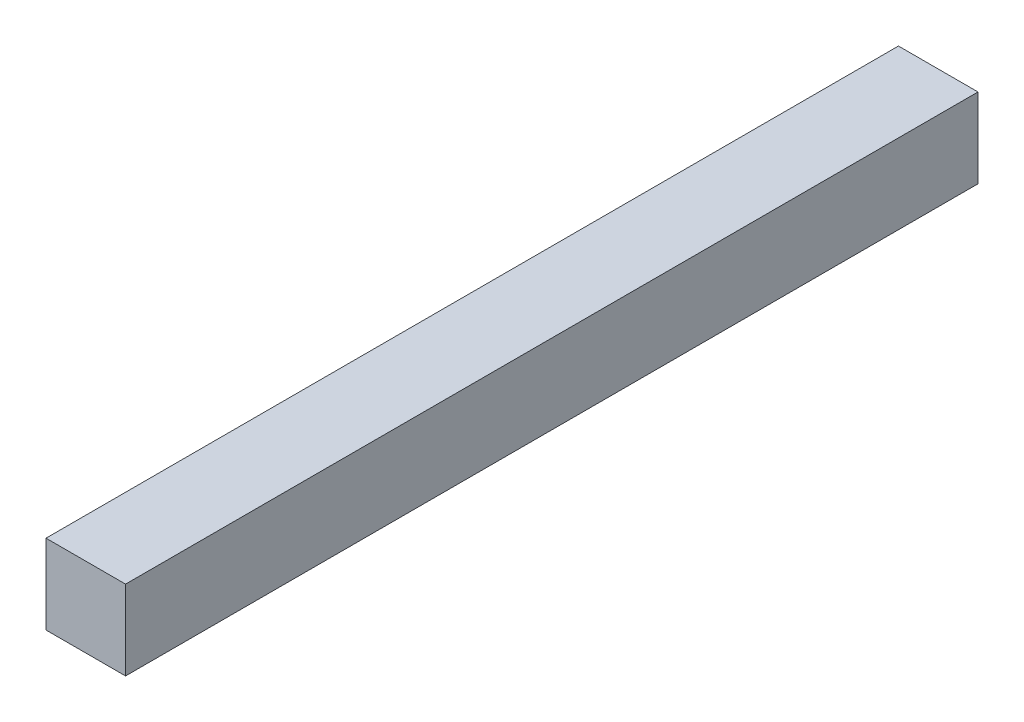
ISO-10303-21;
HEADER;
FILE_DESCRIPTION(('STEP AP214'),'2;1');
FILE_NAME('part.step','',(''),(''),'','','');
FILE_SCHEMA(('AUTOMOTIVE_DESIGN { 1 0 10303 214 1 1 1 1 }'));
ENDSEC;
DATA;
#1=APPLICATION_CONTEXT('core data for automotive mechanical design processes');
#2=APPLICATION_PROTOCOL_DEFINITION('international standard','automotive_design',2000,#1);
#3=PRODUCT_CONTEXT('',#1,'mechanical');
#4=PRODUCT('Part','Part','',(#3));
#5=PRODUCT_RELATED_PRODUCT_CATEGORY('part','',(#4));
#6=PRODUCT_DEFINITION_FORMATION('','',#4);
#7=PRODUCT_DEFINITION_CONTEXT('part definition',#1,'design');
#8=PRODUCT_DEFINITION('design','',#6,#7);
#9=PRODUCT_DEFINITION_SHAPE('','',#8);
#10=(LENGTH_UNIT() NAMED_UNIT(*) SI_UNIT(.MILLI.,.METRE.));
#11=(NAMED_UNIT(*) PLANE_ANGLE_UNIT() SI_UNIT($,.RADIAN.));
#12=(NAMED_UNIT(*) SI_UNIT($,.STERADIAN.) SOLID_ANGLE_UNIT());
#13=UNCERTAINTY_MEASURE_WITH_UNIT(LENGTH_MEASURE(1.E-05),#10,'distance_accuracy_value','');
#14=(GEOMETRIC_REPRESENTATION_CONTEXT(3) GLOBAL_UNCERTAINTY_ASSIGNED_CONTEXT((#13)) GLOBAL_UNIT_ASSIGNED_CONTEXT((#10,
#11,#12)) REPRESENTATION_CONTEXT('',''));
#15=CARTESIAN_POINT('',(0.,0.,0.));
#16=DIRECTION('',(0.,0.,1.));
#17=DIRECTION('',(1.,0.,0.));
#18=AXIS2_PLACEMENT_3D('',#15,#16,#17);
#19=CARTESIAN_POINT('',(1.4,1.4,30.));
#20=DIRECTION('',(-1.,0.,0.));
#21=DIRECTION('',(0.,-1.,0.));
#22=AXIS2_PLACEMENT_3D('',#19,#20,#21);
#23=PLANE('',#22);
#24=DIRECTION('',(0.,1.,0.));
#25=VECTOR('',#24,1.);
#26=CARTESIAN_POINT('',(1.4,1.4,0.));
#27=LINE('',#26,#25);
#28=CARTESIAN_POINT('',(1.4,-1.4,0.));
#29=VERTEX_POINT('',#28);
#30=CARTESIAN_POINT('',(1.4,1.4,0.));
#31=VERTEX_POINT('',#30);
#32=EDGE_CURVE('E107',#29,#31,#27,.T.);
#33=ORIENTED_EDGE('',*,*,#32,.T.);
#34=DIRECTION('',(0.,0.,-1.));
#35=VECTOR('',#34,1.);
#36=CARTESIAN_POINT('',(1.4,1.4,30.));
#37=LINE('',#36,#35);
#38=CARTESIAN_POINT('',(1.4,1.4,30.));
#39=VERTEX_POINT('',#38);
#40=EDGE_CURVE('E11',#39,#31,#37,.T.);
#41=ORIENTED_EDGE('',*,*,#40,.F.);
#42=DIRECTION('',(0.,1.,0.));
#43=VECTOR('',#42,1.);
#44=CARTESIAN_POINT('',(1.4,1.4,30.));
#45=LINE('',#44,#43);
#46=CARTESIAN_POINT('',(1.4,-1.4,30.));
#47=VERTEX_POINT('',#46);
#48=EDGE_CURVE('E91',#47,#39,#45,.T.);
#49=ORIENTED_EDGE('',*,*,#48,.F.);
#50=DIRECTION('',(0.,0.,-1.));
#51=VECTOR('',#50,1.);
#52=CARTESIAN_POINT('',(1.4,-1.4,30.));
#53=LINE('',#52,#51);
#54=EDGE_CURVE('E103',#47,#29,#53,.T.);
#55=ORIENTED_EDGE('',*,*,#54,.T.);
#56=EDGE_LOOP('',(#33,#41,#49,#55));
#57=FACE_BOUND('',#56,.T.);
#58=ADVANCED_FACE('F39',(#57),#23,.F.);
#59=CARTESIAN_POINT('',(-1.4,1.4,30.));
#60=DIRECTION('',(0.,-1.,0.));
#61=DIRECTION('',(0.,0.,-1.));
#62=AXIS2_PLACEMENT_3D('',#59,#60,#61);
#63=PLANE('',#62);
#64=DIRECTION('',(-1.,0.,0.));
#65=VECTOR('',#64,1.);
#66=CARTESIAN_POINT('',(-1.4,1.4,0.));
#67=LINE('',#66,#65);
#68=CARTESIAN_POINT('',(-1.4,1.4,0.));
#69=VERTEX_POINT('',#68);
#70=EDGE_CURVE('E96',#31,#69,#67,.T.);
#71=ORIENTED_EDGE('',*,*,#70,.T.);
#72=DIRECTION('',(0.,0.,-1.));
#73=VECTOR('',#72,1.);
#74=CARTESIAN_POINT('',(-1.4,1.4,30.));
#75=LINE('',#74,#73);
#76=CARTESIAN_POINT('',(-1.4,1.4,30.));
#77=VERTEX_POINT('',#76);
#78=EDGE_CURVE('E48',#77,#69,#75,.T.);
#79=ORIENTED_EDGE('',*,*,#78,.F.);
#80=DIRECTION('',(-1.,0.,0.));
#81=VECTOR('',#80,1.);
#82=CARTESIAN_POINT('',(-1.4,1.4,30.));
#83=LINE('',#82,#81);
#84=EDGE_CURVE('E86',#39,#77,#83,.T.);
#85=ORIENTED_EDGE('',*,*,#84,.F.);
#86=ORIENTED_EDGE('',*,*,#40,.T.);
#87=EDGE_LOOP('',(#71,#79,#85,#86));
#88=FACE_BOUND('',#87,.T.);
#89=ADVANCED_FACE('F95',(#88),#63,.F.);
#90=CARTESIAN_POINT('',(-1.4,1.4,30.));
#91=DIRECTION('',(1.,0.,0.));
#92=DIRECTION('',(0.,1.,0.));
#93=AXIS2_PLACEMENT_3D('',#90,#91,#92);
#94=PLANE('',#93);
#95=DIRECTION('',(0.,-1.,0.));
#96=VECTOR('',#95,1.);
#97=CARTESIAN_POINT('',(-1.4,1.4,0.));
#98=LINE('',#97,#96);
#99=CARTESIAN_POINT('',(-1.4,-1.4,0.));
#100=VERTEX_POINT('',#99);
#101=EDGE_CURVE('E73',#69,#100,#98,.T.);
#102=ORIENTED_EDGE('',*,*,#101,.T.);
#103=DIRECTION('',(0.,0.,-1.));
#104=VECTOR('',#103,1.);
#105=CARTESIAN_POINT('',(-1.4,-1.4,30.));
#106=LINE('',#105,#104);
#107=CARTESIAN_POINT('',(-1.4,-1.4,30.));
#108=VERTEX_POINT('',#107);
#109=EDGE_CURVE('E98',#108,#100,#106,.T.);
#110=ORIENTED_EDGE('',*,*,#109,.F.);
#111=DIRECTION('',(0.,-1.,0.));
#112=VECTOR('',#111,1.);
#113=CARTESIAN_POINT('',(-1.4,1.4,30.));
#114=LINE('',#113,#112);
#115=EDGE_CURVE('E89',#77,#108,#114,.T.);
#116=ORIENTED_EDGE('',*,*,#115,.F.);
#117=ORIENTED_EDGE('',*,*,#78,.T.);
#118=EDGE_LOOP('',(#102,#110,#116,#117));
#119=FACE_BOUND('',#118,.T.);
#120=ADVANCED_FACE('F99',(#119),#94,.F.);
#121=CARTESIAN_POINT('',(-1.4,-1.4,30.));
#122=DIRECTION('',(0.,1.,0.));
#123=DIRECTION('',(0.,0.,1.));
#124=AXIS2_PLACEMENT_3D('',#121,#122,#123);
#125=PLANE('',#124);
#126=DIRECTION('',(1.,0.,0.));
#127=VECTOR('',#126,1.);
#128=CARTESIAN_POINT('',(-1.4,-1.4,0.));
#129=LINE('',#128,#127);
#130=EDGE_CURVE('E79',#100,#29,#129,.T.);
#131=ORIENTED_EDGE('',*,*,#130,.T.);
#132=ORIENTED_EDGE('',*,*,#54,.F.);
#133=DIRECTION('',(1.,0.,0.));
#134=VECTOR('',#133,1.);
#135=CARTESIAN_POINT('',(-1.4,-1.4,30.));
#136=LINE('',#135,#134);
#137=EDGE_CURVE('E56',#108,#47,#136,.T.);
#138=ORIENTED_EDGE('',*,*,#137,.F.);
#139=ORIENTED_EDGE('',*,*,#109,.T.);
#140=EDGE_LOOP('',(#131,#132,#138,#139));
#141=FACE_BOUND('',#140,.T.);
#142=ADVANCED_FACE('F120',(#141),#125,.F.);
#143=CARTESIAN_POINT('',(0.,0.,30.));
#144=DIRECTION('',(0.,0.,1.));
#145=DIRECTION('',(1.,0.,0.));
#146=AXIS2_PLACEMENT_3D('',#143,#144,#145);
#147=PLANE('',#146);
#148=ORIENTED_EDGE('',*,*,#48,.T.);
#149=ORIENTED_EDGE('',*,*,#84,.T.);
#150=ORIENTED_EDGE('',*,*,#115,.T.);
#151=ORIENTED_EDGE('',*,*,#137,.T.);
#152=EDGE_LOOP('',(#148,#149,#150,#151));
#153=FACE_BOUND('',#152,.T.);
#154=ADVANCED_FACE('F87',(#153),#147,.T.);
#155=CARTESIAN_POINT('',(0.,0.,0.));
#156=DIRECTION('',(0.,0.,1.));
#157=DIRECTION('',(1.,0.,0.));
#158=AXIS2_PLACEMENT_3D('',#155,#156,#157);
#159=PLANE('',#158);
#160=ORIENTED_EDGE('',*,*,#32,.F.);
#161=ORIENTED_EDGE('',*,*,#130,.F.);
#162=ORIENTED_EDGE('',*,*,#101,.F.);
#163=ORIENTED_EDGE('',*,*,#70,.F.);
#164=EDGE_LOOP('',(#160,#161,#162,#163));
#165=FACE_BOUND('',#164,.T.);
#166=ADVANCED_FACE('F123',(#165),#159,.F.);
#167=CLOSED_SHELL('',(#58,#89,#120,#142,#154,#166));
#168=MANIFOLD_SOLID_BREP('B2',#167);
#169=ADVANCED_BREP_SHAPE_REPRESENTATION('',(#18,#168),#14);
#170=SHAPE_DEFINITION_REPRESENTATION(#9,#169);
ENDSEC;
END-ISO-10303-21;
